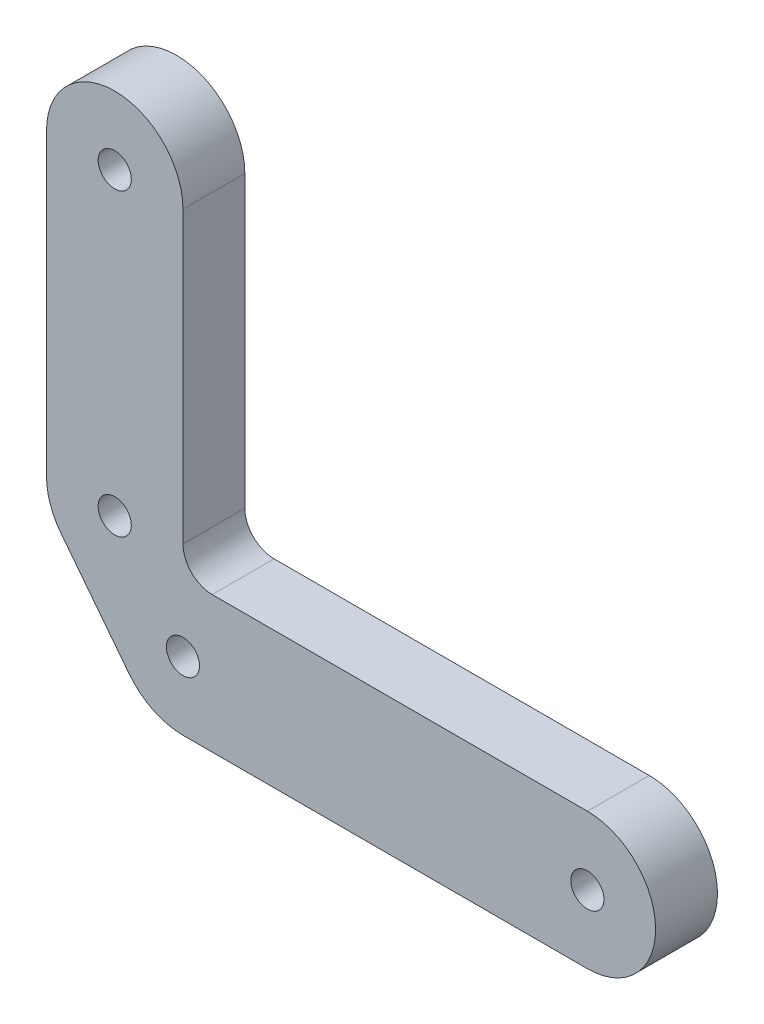
ISO-10303-21;
HEADER;
FILE_DESCRIPTION(('STEP AP214'),'2;1');
FILE_NAME('part.step','',(''),(''),'','','');
FILE_SCHEMA(('AUTOMOTIVE_DESIGN { 1 0 10303 214 1 1 1 1 }'));
ENDSEC;
DATA;
#1=APPLICATION_CONTEXT('core data for automotive mechanical design processes');
#2=APPLICATION_PROTOCOL_DEFINITION('international standard','automotive_design',2000,#1);
#3=PRODUCT_CONTEXT('',#1,'mechanical');
#4=PRODUCT('Part','Part','',(#3));
#5=PRODUCT_RELATED_PRODUCT_CATEGORY('part','',(#4));
#6=PRODUCT_DEFINITION_FORMATION('','',#4);
#7=PRODUCT_DEFINITION_CONTEXT('part definition',#1,'design');
#8=PRODUCT_DEFINITION('design','',#6,#7);
#9=PRODUCT_DEFINITION_SHAPE('','',#8);
#10=(LENGTH_UNIT() NAMED_UNIT(*) SI_UNIT(.MILLI.,.METRE.));
#11=(NAMED_UNIT(*) PLANE_ANGLE_UNIT() SI_UNIT($,.RADIAN.));
#12=(NAMED_UNIT(*) SI_UNIT($,.STERADIAN.) SOLID_ANGLE_UNIT());
#13=UNCERTAINTY_MEASURE_WITH_UNIT(LENGTH_MEASURE(1.E-05),#10,'distance_accuracy_value','');
#14=(GEOMETRIC_REPRESENTATION_CONTEXT(3) GLOBAL_UNCERTAINTY_ASSIGNED_CONTEXT((#13)) GLOBAL_UNIT_ASSIGNED_CONTEXT((#10,
#11,#12)) REPRESENTATION_CONTEXT('',''));
#15=CARTESIAN_POINT('',(0.,0.,0.));
#16=DIRECTION('',(0.,0.,1.));
#17=DIRECTION('',(1.,0.,0.));
#18=AXIS2_PLACEMENT_3D('',#15,#16,#17);
#19=CARTESIAN_POINT('',(-6.99999999999999,39.75,6.35));
#20=DIRECTION('',(0.,0.,-1.));
#21=DIRECTION('',(-1.,0.,0.));
#22=AXIS2_PLACEMENT_3D('',#19,#20,#21);
#23=CYLINDRICAL_SURFACE('',#22,6.99999999999999);
#24=CARTESIAN_POINT('',(-6.99999999999999,39.75,0.));
#25=DIRECTION('',(0.,0.,1.));
#26=DIRECTION('',(-1.,0.,0.));
#27=AXIS2_PLACEMENT_3D('',#24,#25,#26);
#28=CIRCLE('',#27,6.99999999999999);
#29=CARTESIAN_POINT('',(0.,39.75,0.));
#30=VERTEX_POINT('',#29);
#31=CARTESIAN_POINT('',(-14.,39.75,0.));
#32=VERTEX_POINT('',#31);
#33=EDGE_CURVE('E133',#30,#32,#28,.T.);
#34=ORIENTED_EDGE('',*,*,#33,.T.);
#35=DIRECTION('',(0.,0.,-1.));
#36=VECTOR('',#35,1.);
#37=CARTESIAN_POINT('',(-14.,39.75,6.35));
#38=LINE('',#37,#36);
#39=CARTESIAN_POINT('',(-14.,39.75,6.35));
#40=VERTEX_POINT('',#39);
#41=EDGE_CURVE('E114',#40,#32,#38,.T.);
#42=ORIENTED_EDGE('',*,*,#41,.F.);
#43=CARTESIAN_POINT('',(-6.99999999999999,39.75,6.35));
#44=DIRECTION('',(0.,0.,1.));
#45=DIRECTION('',(-1.,0.,0.));
#46=AXIS2_PLACEMENT_3D('',#43,#44,#45);
#47=CIRCLE('',#46,6.99999999999999);
#48=CARTESIAN_POINT('',(0.,39.75,6.35));
#49=VERTEX_POINT('',#48);
#50=EDGE_CURVE('E121',#49,#40,#47,.T.);
#51=ORIENTED_EDGE('',*,*,#50,.F.);
#52=DIRECTION('',(0.,0.,-1.));
#53=VECTOR('',#52,1.);
#54=CARTESIAN_POINT('',(0.,39.75,6.35));
#55=LINE('',#54,#53);
#56=EDGE_CURVE('E156',#49,#30,#55,.T.);
#57=ORIENTED_EDGE('',*,*,#56,.T.);
#58=EDGE_LOOP('',(#34,#42,#51,#57));
#59=FACE_BOUND('',#58,.T.);
#60=ADVANCED_FACE('F33',(#59),#23,.T.);
#61=CARTESIAN_POINT('',(-14.,39.75,6.35));
#62=DIRECTION('',(1.,0.,0.));
#63=DIRECTION('',(0.,0.,-1.));
#64=AXIS2_PLACEMENT_3D('',#61,#62,#63);
#65=PLANE('',#64);
#66=DIRECTION('',(0.,-1.,0.));
#67=VECTOR('',#66,1.);
#68=CARTESIAN_POINT('',(-14.,39.75,0.));
#69=LINE('',#68,#67);
#70=CARTESIAN_POINT('',(-14.,8.99999999999999,0.));
#71=VERTEX_POINT('',#70);
#72=EDGE_CURVE('E171',#32,#71,#69,.T.);
#73=ORIENTED_EDGE('',*,*,#72,.T.);
#74=DIRECTION('',(0.,0.,-1.));
#75=VECTOR('',#74,1.);
#76=CARTESIAN_POINT('',(-14.,8.99999999999999,6.35));
#77=LINE('',#76,#75);
#78=CARTESIAN_POINT('',(-14.,8.99999999999999,6.35));
#79=VERTEX_POINT('',#78);
#80=EDGE_CURVE('E117',#79,#71,#77,.T.);
#81=ORIENTED_EDGE('',*,*,#80,.F.);
#82=DIRECTION('',(0.,-1.,0.));
#83=VECTOR('',#82,1.);
#84=CARTESIAN_POINT('',(-14.,39.75,6.35));
#85=LINE('',#84,#83);
#86=EDGE_CURVE('E110',#40,#79,#85,.T.);
#87=ORIENTED_EDGE('',*,*,#86,.F.);
#88=ORIENTED_EDGE('',*,*,#41,.T.);
#89=EDGE_LOOP('',(#73,#81,#87,#88));
#90=FACE_BOUND('',#89,.T.);
#91=ADVANCED_FACE('F112',(#90),#65,.F.);
#92=CARTESIAN_POINT('',(-6.99999999999999,8.99999999999999,6.35));
#93=DIRECTION('',(0.,0.,-1.));
#94=DIRECTION('',(-1.,0.,0.));
#95=AXIS2_PLACEMENT_3D('',#92,#93,#94);
#96=CYLINDRICAL_SURFACE('',#95,6.99999999999999);
#97=CARTESIAN_POINT('',(-6.99999999999999,8.99999999999999,0.));
#98=DIRECTION('',(0.,0.,1.));
#99=DIRECTION('',(1.,0.,0.));
#100=AXIS2_PLACEMENT_3D('',#97,#98,#99);
#101=CIRCLE('',#100,6.99999999999999);
#102=CARTESIAN_POINT('',(-12.5254655216343,4.70241570539557,0.));
#103=VERTEX_POINT('',#102);
#104=EDGE_CURVE('E169',#71,#103,#101,.T.);
#105=ORIENTED_EDGE('',*,*,#104,.T.);
#106=DIRECTION('',(0.,0.,-1.));
#107=VECTOR('',#106,1.);
#108=CARTESIAN_POINT('',(-12.5254655216343,4.70241570539557,6.35));
#109=LINE('',#108,#107);
#110=CARTESIAN_POINT('',(-12.5254655216343,4.70241570539557,6.35));
#111=VERTEX_POINT('',#110);
#112=EDGE_CURVE('E138',#111,#103,#109,.T.);
#113=ORIENTED_EDGE('',*,*,#112,.F.);
#114=CARTESIAN_POINT('',(-6.99999999999999,8.99999999999999,6.35));
#115=DIRECTION('',(0.,0.,1.));
#116=DIRECTION('',(1.,0.,0.));
#117=AXIS2_PLACEMENT_3D('',#114,#115,#116);
#118=CIRCLE('',#117,6.99999999999999);
#119=EDGE_CURVE('E120',#79,#111,#118,.T.);
#120=ORIENTED_EDGE('',*,*,#119,.F.);
#121=ORIENTED_EDGE('',*,*,#80,.T.);
#122=EDGE_LOOP('',(#105,#113,#120,#121));
#123=FACE_BOUND('',#122,.T.);
#124=ADVANCED_FACE('F242',(#123),#96,.T.);
#125=CARTESIAN_POINT('',(-12.5254655216343,4.70241570539557,6.35));
#126=DIRECTION('',(0.789352217376327,0.61394061351492,0.));
#127=DIRECTION('',(-0.61394061351492,0.789352217376327,0.));
#128=AXIS2_PLACEMENT_3D('',#125,#126,#127);
#129=PLANE('',#128);
#130=DIRECTION('',(0.61394061351492,-0.789352217376327,0.));
#131=VECTOR('',#130,1.);
#132=CARTESIAN_POINT('',(-12.5254655216343,4.70241570539557,0.));
#133=LINE('',#132,#131);
#134=CARTESIAN_POINT('',(-5.52546552163428,-4.29758429460443,0.));
#135=VERTEX_POINT('',#134);
#136=EDGE_CURVE('E167',#103,#135,#133,.T.);
#137=ORIENTED_EDGE('',*,*,#136,.T.);
#138=DIRECTION('',(0.,0.,-1.));
#139=VECTOR('',#138,1.);
#140=CARTESIAN_POINT('',(-5.52546552163428,-4.29758429460443,6.35));
#141=LINE('',#140,#139);
#142=CARTESIAN_POINT('',(-5.52546552163428,-4.29758429460443,6.35));
#143=VERTEX_POINT('',#142);
#144=EDGE_CURVE('E144',#143,#135,#141,.T.);
#145=ORIENTED_EDGE('',*,*,#144,.F.);
#146=DIRECTION('',(0.61394061351492,-0.789352217376327,0.));
#147=VECTOR('',#146,1.);
#148=CARTESIAN_POINT('',(-12.5254655216343,4.70241570539557,6.35));
#149=LINE('',#148,#147);
#150=EDGE_CURVE('E184',#111,#143,#149,.T.);
#151=ORIENTED_EDGE('',*,*,#150,.F.);
#152=ORIENTED_EDGE('',*,*,#112,.T.);
#153=EDGE_LOOP('',(#137,#145,#151,#152));
#154=FACE_BOUND('',#153,.T.);
#155=ADVANCED_FACE('F247',(#154),#129,.F.);
#156=CARTESIAN_POINT('',(0.,0.,6.35));
#157=DIRECTION('',(0.,0.,-1.));
#158=DIRECTION('',(-1.,0.,0.));
#159=AXIS2_PLACEMENT_3D('',#156,#157,#158);
#160=CYLINDRICAL_SURFACE('',#159,6.99999999999999);
#161=CARTESIAN_POINT('',(0.,0.,0.));
#162=DIRECTION('',(0.,0.,1.));
#163=DIRECTION('',(1.,0.,0.));
#164=AXIS2_PLACEMENT_3D('',#161,#162,#163);
#165=CIRCLE('',#164,6.99999999999999);
#166=CARTESIAN_POINT('',(0.,-6.99999999999999,0.));
#167=VERTEX_POINT('',#166);
#168=EDGE_CURVE('E165',#135,#167,#165,.T.);
#169=ORIENTED_EDGE('',*,*,#168,.T.);
#170=DIRECTION('',(0.,0.,-1.));
#171=VECTOR('',#170,1.);
#172=CARTESIAN_POINT('',(0.,-6.99999999999999,6.35));
#173=LINE('',#172,#171);
#174=CARTESIAN_POINT('',(0.,-6.99999999999999,6.35));
#175=VERTEX_POINT('',#174);
#176=EDGE_CURVE('E147',#175,#167,#173,.T.);
#177=ORIENTED_EDGE('',*,*,#176,.F.);
#178=CARTESIAN_POINT('',(0.,0.,6.35));
#179=DIRECTION('',(0.,0.,1.));
#180=DIRECTION('',(1.,0.,0.));
#181=AXIS2_PLACEMENT_3D('',#178,#179,#180);
#182=CIRCLE('',#181,6.99999999999999);
#183=EDGE_CURVE('E182',#143,#175,#182,.T.);
#184=ORIENTED_EDGE('',*,*,#183,.F.);
#185=ORIENTED_EDGE('',*,*,#144,.T.);
#186=EDGE_LOOP('',(#169,#177,#184,#185));
#187=FACE_BOUND('',#186,.T.);
#188=ADVANCED_FACE('F251',(#187),#160,.T.);
#189=CARTESIAN_POINT('',(0.,-7.,6.35));
#190=DIRECTION('',(0.,1.,0.));
#191=DIRECTION('',(0.,0.,1.));
#192=AXIS2_PLACEMENT_3D('',#189,#190,#191);
#193=PLANE('',#192);
#194=DIRECTION('',(1.,0.,0.));
#195=VECTOR('',#194,1.);
#196=CARTESIAN_POINT('',(0.,-7.,0.));
#197=LINE('',#196,#195);
#198=CARTESIAN_POINT('',(41.5,-7.,0.));
#199=VERTEX_POINT('',#198);
#200=EDGE_CURVE('E163',#167,#199,#197,.T.);
#201=ORIENTED_EDGE('',*,*,#200,.T.);
#202=DIRECTION('',(0.,0.,-1.));
#203=VECTOR('',#202,1.);
#204=CARTESIAN_POINT('',(41.5,-7.,6.35));
#205=LINE('',#204,#203);
#206=CARTESIAN_POINT('',(41.5,-7.,6.35));
#207=VERTEX_POINT('',#206);
#208=EDGE_CURVE('E150',#207,#199,#205,.T.);
#209=ORIENTED_EDGE('',*,*,#208,.F.);
#210=DIRECTION('',(1.,0.,0.));
#211=VECTOR('',#210,1.);
#212=CARTESIAN_POINT('',(0.,-7.,6.35));
#213=LINE('',#212,#211);
#214=EDGE_CURVE('E180',#175,#207,#213,.T.);
#215=ORIENTED_EDGE('',*,*,#214,.F.);
#216=ORIENTED_EDGE('',*,*,#176,.T.);
#217=EDGE_LOOP('',(#201,#209,#215,#216));
#218=FACE_BOUND('',#217,.T.);
#219=ADVANCED_FACE('F255',(#218),#193,.F.);
#220=CARTESIAN_POINT('',(41.5,0.,6.35));
#221=DIRECTION('',(0.,0.,-1.));
#222=DIRECTION('',(-1.,0.,0.));
#223=AXIS2_PLACEMENT_3D('',#220,#221,#222);
#224=CYLINDRICAL_SURFACE('',#223,6.99999999999999);
#225=CARTESIAN_POINT('',(41.5,0.,0.));
#226=DIRECTION('',(0.,0.,1.));
#227=DIRECTION('',(1.,0.,0.));
#228=AXIS2_PLACEMENT_3D('',#225,#226,#227);
#229=CIRCLE('',#228,6.99999999999999);
#230=CARTESIAN_POINT('',(41.5,6.99999999999999,0.));
#231=VERTEX_POINT('',#230);
#232=EDGE_CURVE('E161',#199,#231,#229,.T.);
#233=ORIENTED_EDGE('',*,*,#232,.T.);
#234=DIRECTION('',(0.,0.,-1.));
#235=VECTOR('',#234,1.);
#236=CARTESIAN_POINT('',(41.5,6.99999999999999,6.35));
#237=LINE('',#236,#235);
#238=CARTESIAN_POINT('',(41.5,6.99999999999999,6.35));
#239=VERTEX_POINT('',#238);
#240=EDGE_CURVE('E153',#239,#231,#237,.T.);
#241=ORIENTED_EDGE('',*,*,#240,.F.);
#242=CARTESIAN_POINT('',(41.5,0.,6.35));
#243=DIRECTION('',(0.,0.,1.));
#244=DIRECTION('',(1.,0.,0.));
#245=AXIS2_PLACEMENT_3D('',#242,#243,#244);
#246=CIRCLE('',#245,6.99999999999999);
#247=EDGE_CURVE('E178',#207,#239,#246,.T.);
#248=ORIENTED_EDGE('',*,*,#247,.F.);
#249=ORIENTED_EDGE('',*,*,#208,.T.);
#250=EDGE_LOOP('',(#233,#241,#248,#249));
#251=FACE_BOUND('',#250,.T.);
#252=ADVANCED_FACE('F259',(#251),#224,.T.);
#253=CARTESIAN_POINT('',(41.5,6.99999999999999,6.35));
#254=DIRECTION('',(0.,-1.,0.));
#255=DIRECTION('',(1.,0.,0.));
#256=AXIS2_PLACEMENT_3D('',#253,#254,#255);
#257=PLANE('',#256);
#258=DIRECTION('',(-1.,0.,0.));
#259=VECTOR('',#258,1.);
#260=CARTESIAN_POINT('',(41.5,6.99999999999999,0.));
#261=LINE('',#260,#259);
#262=CARTESIAN_POINT('',(3.,6.99999999999998,0.));
#263=VERTEX_POINT('',#262);
#264=EDGE_CURVE('E159',#231,#263,#261,.T.);
#265=ORIENTED_EDGE('',*,*,#264,.T.);
#266=DIRECTION('',(0.,0.,-1.));
#267=VECTOR('',#266,1.);
#268=CARTESIAN_POINT('',(3.,6.99999999999998,6.35));
#269=LINE('',#268,#267);
#270=CARTESIAN_POINT('',(3.,6.99999999999998,6.35));
#271=VERTEX_POINT('',#270);
#272=EDGE_CURVE('E48',#263,#271,#269,.F.);
#273=ORIENTED_EDGE('',*,*,#272,.T.);
#274=DIRECTION('',(-1.,0.,0.));
#275=VECTOR('',#274,1.);
#276=CARTESIAN_POINT('',(41.5,6.99999999999999,6.35));
#277=LINE('',#276,#275);
#278=EDGE_CURVE('E176',#239,#271,#277,.T.);
#279=ORIENTED_EDGE('',*,*,#278,.F.);
#280=ORIENTED_EDGE('',*,*,#240,.T.);
#281=EDGE_LOOP('',(#265,#273,#279,#280));
#282=FACE_BOUND('',#281,.T.);
#283=ADVANCED_FACE('F263',(#282),#257,.F.);
#284=CARTESIAN_POINT('',(0.,6.99999999999998,6.35));
#285=DIRECTION('',(-1.,0.,0.));
#286=DIRECTION('',(0.,0.,1.));
#287=AXIS2_PLACEMENT_3D('',#284,#285,#286);
#288=PLANE('',#287);
#289=DIRECTION('',(0.,1.,0.));
#290=VECTOR('',#289,1.);
#291=CARTESIAN_POINT('',(0.,6.99999999999998,6.35));
#292=LINE('',#291,#290);
#293=CARTESIAN_POINT('',(0.,9.99999999999998,6.35));
#294=VERTEX_POINT('',#293);
#295=EDGE_CURVE('E126',#294,#49,#292,.T.);
#296=ORIENTED_EDGE('',*,*,#295,.F.);
#297=DIRECTION('',(0.,0.,-1.));
#298=VECTOR('',#297,1.);
#299=CARTESIAN_POINT('',(0.,9.99999999999998,0.));
#300=LINE('',#299,#298);
#301=CARTESIAN_POINT('',(0.,9.99999999999998,0.));
#302=VERTEX_POINT('',#301);
#303=EDGE_CURVE('E134',#294,#302,#300,.T.);
#304=ORIENTED_EDGE('',*,*,#303,.T.);
#305=DIRECTION('',(0.,1.,0.));
#306=VECTOR('',#305,1.);
#307=CARTESIAN_POINT('',(0.,6.99999999999998,0.));
#308=LINE('',#307,#306);
#309=EDGE_CURVE('E130',#302,#30,#308,.T.);
#310=ORIENTED_EDGE('',*,*,#309,.T.);
#311=ORIENTED_EDGE('',*,*,#56,.F.);
#312=EDGE_LOOP('',(#296,#304,#310,#311));
#313=FACE_BOUND('',#312,.T.);
#314=ADVANCED_FACE('F216',(#313),#288,.F.);
#315=CARTESIAN_POINT('',(-6.99999999999999,39.75,6.35));
#316=DIRECTION('',(0.,0.,-1.));
#317=DIRECTION('',(-1.,0.,0.));
#318=AXIS2_PLACEMENT_3D('',#315,#316,#317);
#319=PLANE('',#318);
#320=CARTESIAN_POINT('',(-6.99999999999999,39.75,6.35));
#321=DIRECTION('',(0.,0.,1.));
#322=DIRECTION('',(1.,0.,0.));
#323=AXIS2_PLACEMENT_3D('',#320,#321,#322);
#324=CIRCLE('',#323,1.7);
#325=CARTESIAN_POINT('',(-5.3,39.75,6.35));
#326=VERTEX_POINT('',#325);
#327=EDGE_CURVE('E207',#326,#326,#324,.T.);
#328=ORIENTED_EDGE('',*,*,#327,.F.);
#329=EDGE_LOOP('',(#328));
#330=FACE_BOUND('',#329,.T.);
#331=CARTESIAN_POINT('',(-6.99999999999999,8.99999999999999,6.35));
#332=DIRECTION('',(0.,0.,1.));
#333=DIRECTION('',(1.,0.,0.));
#334=AXIS2_PLACEMENT_3D('',#331,#332,#333);
#335=CIRCLE('',#334,1.7);
#336=CARTESIAN_POINT('',(-5.29999999999999,8.99999999999999,6.35));
#337=VERTEX_POINT('',#336);
#338=EDGE_CURVE('E201',#337,#337,#335,.T.);
#339=ORIENTED_EDGE('',*,*,#338,.F.);
#340=EDGE_LOOP('',(#339));
#341=FACE_BOUND('',#340,.T.);
#342=CARTESIAN_POINT('',(0.,0.,6.35));
#343=DIRECTION('',(0.,0.,1.));
#344=DIRECTION('',(1.,0.,0.));
#345=AXIS2_PLACEMENT_3D('',#342,#343,#344);
#346=CIRCLE('',#345,1.7);
#347=CARTESIAN_POINT('',(1.7,0.,6.35));
#348=VERTEX_POINT('',#347);
#349=EDGE_CURVE('E195',#348,#348,#346,.T.);
#350=ORIENTED_EDGE('',*,*,#349,.F.);
#351=EDGE_LOOP('',(#350));
#352=FACE_BOUND('',#351,.T.);
#353=CARTESIAN_POINT('',(41.5,0.,6.35));
#354=DIRECTION('',(0.,0.,1.));
#355=DIRECTION('',(1.,0.,0.));
#356=AXIS2_PLACEMENT_3D('',#353,#354,#355);
#357=CIRCLE('',#356,1.69999999999999);
#358=CARTESIAN_POINT('',(43.2,0.,6.35));
#359=VERTEX_POINT('',#358);
#360=EDGE_CURVE('E189',#359,#359,#357,.T.);
#361=ORIENTED_EDGE('',*,*,#360,.F.);
#362=EDGE_LOOP('',(#361));
#363=FACE_BOUND('',#362,.T.);
#364=ORIENTED_EDGE('',*,*,#50,.T.);
#365=ORIENTED_EDGE('',*,*,#86,.T.);
#366=ORIENTED_EDGE('',*,*,#119,.T.);
#367=ORIENTED_EDGE('',*,*,#150,.T.);
#368=ORIENTED_EDGE('',*,*,#183,.T.);
#369=ORIENTED_EDGE('',*,*,#214,.T.);
#370=ORIENTED_EDGE('',*,*,#247,.T.);
#371=ORIENTED_EDGE('',*,*,#278,.T.);
#372=CARTESIAN_POINT('',(3.,9.99999999999998,6.35));
#373=DIRECTION('',(0.,0.,-1.));
#374=DIRECTION('',(-1.,0.,0.));
#375=AXIS2_PLACEMENT_3D('',#372,#373,#374);
#376=CIRCLE('',#375,3.);
#377=EDGE_CURVE('E11',#271,#294,#376,.T.);
#378=ORIENTED_EDGE('',*,*,#377,.T.);
#379=ORIENTED_EDGE('',*,*,#295,.T.);
#380=EDGE_LOOP('',(#364,#365,#366,#367,#368,#369,#370,#371,#378,#379));
#381=FACE_BOUND('',#380,.T.);
#382=ADVANCED_FACE('F124',(#330,#341,#352,#363,#381),#319,.F.);
#383=CARTESIAN_POINT('',(-6.99999999999999,39.75,0.));
#384=DIRECTION('',(0.,0.,-1.));
#385=DIRECTION('',(-1.,0.,0.));
#386=AXIS2_PLACEMENT_3D('',#383,#384,#385);
#387=PLANE('',#386);
#388=CARTESIAN_POINT('',(-6.99999999999999,39.75,0.));
#389=DIRECTION('',(0.,0.,1.));
#390=DIRECTION('',(1.,0.,0.));
#391=AXIS2_PLACEMENT_3D('',#388,#389,#390);
#392=CIRCLE('',#391,1.7);
#393=CARTESIAN_POINT('',(-5.3,39.75,0.));
#394=VERTEX_POINT('',#393);
#395=EDGE_CURVE('E204',#394,#394,#392,.T.);
#396=ORIENTED_EDGE('',*,*,#395,.T.);
#397=EDGE_LOOP('',(#396));
#398=FACE_BOUND('',#397,.T.);
#399=CARTESIAN_POINT('',(-6.99999999999999,8.99999999999999,0.));
#400=DIRECTION('',(0.,0.,1.));
#401=DIRECTION('',(1.,0.,0.));
#402=AXIS2_PLACEMENT_3D('',#399,#400,#401);
#403=CIRCLE('',#402,1.7);
#404=CARTESIAN_POINT('',(-5.29999999999999,8.99999999999999,0.));
#405=VERTEX_POINT('',#404);
#406=EDGE_CURVE('E198',#405,#405,#403,.T.);
#407=ORIENTED_EDGE('',*,*,#406,.T.);
#408=EDGE_LOOP('',(#407));
#409=FACE_BOUND('',#408,.T.);
#410=CARTESIAN_POINT('',(0.,0.,0.));
#411=DIRECTION('',(0.,0.,1.));
#412=DIRECTION('',(1.,0.,0.));
#413=AXIS2_PLACEMENT_3D('',#410,#411,#412);
#414=CIRCLE('',#413,1.7);
#415=CARTESIAN_POINT('',(1.7,0.,0.));
#416=VERTEX_POINT('',#415);
#417=EDGE_CURVE('E192',#416,#416,#414,.T.);
#418=ORIENTED_EDGE('',*,*,#417,.T.);
#419=EDGE_LOOP('',(#418));
#420=FACE_BOUND('',#419,.T.);
#421=CARTESIAN_POINT('',(41.5,0.,0.));
#422=DIRECTION('',(0.,0.,1.));
#423=DIRECTION('',(1.,0.,0.));
#424=AXIS2_PLACEMENT_3D('',#421,#422,#423);
#425=CIRCLE('',#424,1.69999999999999);
#426=CARTESIAN_POINT('',(43.2,0.,0.));
#427=VERTEX_POINT('',#426);
#428=EDGE_CURVE('E174',#427,#427,#425,.T.);
#429=ORIENTED_EDGE('',*,*,#428,.T.);
#430=EDGE_LOOP('',(#429));
#431=FACE_BOUND('',#430,.T.);
#432=ORIENTED_EDGE('',*,*,#33,.F.);
#433=ORIENTED_EDGE('',*,*,#309,.F.);
#434=CARTESIAN_POINT('',(3.,9.99999999999998,0.));
#435=DIRECTION('',(0.,0.,-1.));
#436=DIRECTION('',(-1.,0.,0.));
#437=AXIS2_PLACEMENT_3D('',#434,#435,#436);
#438=CIRCLE('',#437,3.);
#439=EDGE_CURVE('E41',#302,#263,#438,.F.);
#440=ORIENTED_EDGE('',*,*,#439,.T.);
#441=ORIENTED_EDGE('',*,*,#264,.F.);
#442=ORIENTED_EDGE('',*,*,#232,.F.);
#443=ORIENTED_EDGE('',*,*,#200,.F.);
#444=ORIENTED_EDGE('',*,*,#168,.F.);
#445=ORIENTED_EDGE('',*,*,#136,.F.);
#446=ORIENTED_EDGE('',*,*,#104,.F.);
#447=ORIENTED_EDGE('',*,*,#72,.F.);
#448=EDGE_LOOP('',(#432,#433,#440,#441,#442,#443,#444,#445,#446,#447));
#449=FACE_BOUND('',#448,.T.);
#450=ADVANCED_FACE('F215',(#398,#409,#420,#431,#449),#387,.T.);
#451=CARTESIAN_POINT('',(3.,9.99999999999998,6.35));
#452=DIRECTION('',(0.,0.,1.));
#453=DIRECTION('',(1.,0.,0.));
#454=AXIS2_PLACEMENT_3D('',#451,#452,#453);
#455=CYLINDRICAL_SURFACE('',#454,3.);
#456=ORIENTED_EDGE('',*,*,#377,.F.);
#457=ORIENTED_EDGE('',*,*,#272,.F.);
#458=ORIENTED_EDGE('',*,*,#439,.F.);
#459=ORIENTED_EDGE('',*,*,#303,.F.);
#460=EDGE_LOOP('',(#456,#457,#458,#459));
#461=FACE_BOUND('',#460,.T.);
#462=ADVANCED_FACE('F35',(#461),#455,.F.);
#463=CARTESIAN_POINT('',(41.5,0.,6.35));
#464=DIRECTION('',(0.,0.,1.));
#465=DIRECTION('',(1.,0.,0.));
#466=AXIS2_PLACEMENT_3D('',#463,#464,#465);
#467=CYLINDRICAL_SURFACE('',#466,1.69999999999999);
#468=ORIENTED_EDGE('',*,*,#428,.F.);
#469=EDGE_LOOP('',(#468));
#470=FACE_BOUND('',#469,.T.);
#471=ORIENTED_EDGE('',*,*,#360,.T.);
#472=EDGE_LOOP('',(#471));
#473=FACE_BOUND('',#472,.T.);
#474=ADVANCED_FACE('F224',(#470,#473),#467,.F.);
#475=CARTESIAN_POINT('',(0.,0.,6.35));
#476=DIRECTION('',(0.,0.,1.));
#477=DIRECTION('',(1.,0.,0.));
#478=AXIS2_PLACEMENT_3D('',#475,#476,#477);
#479=CYLINDRICAL_SURFACE('',#478,1.7);
#480=ORIENTED_EDGE('',*,*,#417,.F.);
#481=EDGE_LOOP('',(#480));
#482=FACE_BOUND('',#481,.T.);
#483=ORIENTED_EDGE('',*,*,#349,.T.);
#484=EDGE_LOOP('',(#483));
#485=FACE_BOUND('',#484,.T.);
#486=ADVANCED_FACE('F226',(#482,#485),#479,.F.);
#487=CARTESIAN_POINT('',(-6.99999999999999,8.99999999999999,6.35));
#488=DIRECTION('',(0.,0.,1.));
#489=DIRECTION('',(1.,0.,0.));
#490=AXIS2_PLACEMENT_3D('',#487,#488,#489);
#491=CYLINDRICAL_SURFACE('',#490,1.7);
#492=ORIENTED_EDGE('',*,*,#406,.F.);
#493=EDGE_LOOP('',(#492));
#494=FACE_BOUND('',#493,.T.);
#495=ORIENTED_EDGE('',*,*,#338,.T.);
#496=EDGE_LOOP('',(#495));
#497=FACE_BOUND('',#496,.T.);
#498=ADVANCED_FACE('F233',(#494,#497),#491,.F.);
#499=CARTESIAN_POINT('',(-6.99999999999999,39.75,6.35));
#500=DIRECTION('',(0.,0.,1.));
#501=DIRECTION('',(1.,0.,0.));
#502=AXIS2_PLACEMENT_3D('',#499,#500,#501);
#503=CYLINDRICAL_SURFACE('',#502,1.7);
#504=ORIENTED_EDGE('',*,*,#395,.F.);
#505=EDGE_LOOP('',(#504));
#506=FACE_BOUND('',#505,.T.);
#507=ORIENTED_EDGE('',*,*,#327,.T.);
#508=EDGE_LOOP('',(#507));
#509=FACE_BOUND('',#508,.T.);
#510=ADVANCED_FACE('F211',(#506,#509),#503,.F.);
#511=CLOSED_SHELL('',(#60,#91,#124,#155,#188,#219,#252,#283,#314,#382,#450,#462,#474,#486,#498,#510));
#512=MANIFOLD_SOLID_BREP('B2',#511);
#513=ADVANCED_BREP_SHAPE_REPRESENTATION('',(#18,#512),#14);
#514=SHAPE_DEFINITION_REPRESENTATION(#9,#513);
ENDSEC;
END-ISO-10303-21;
